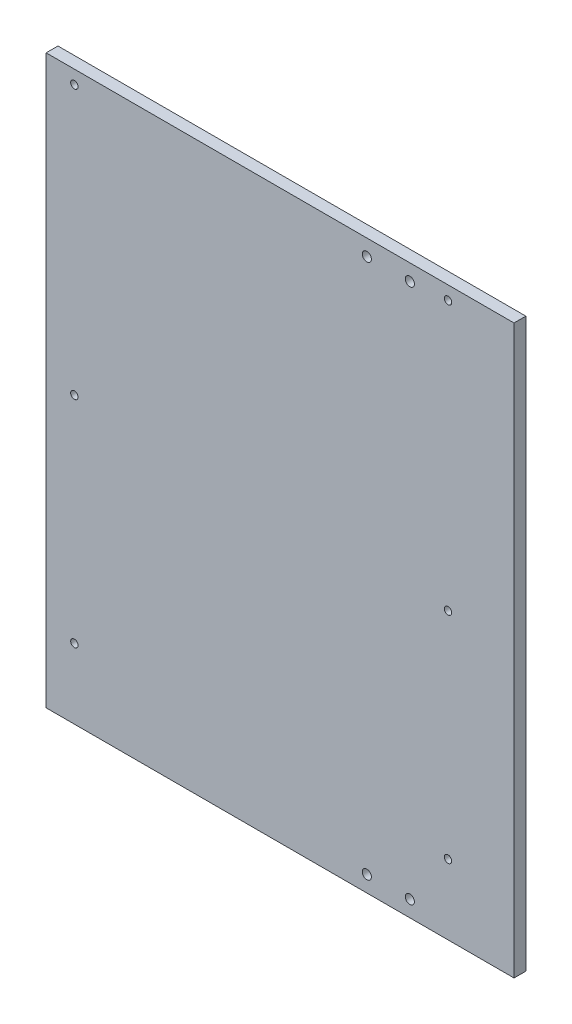
ISO-10303-21;
HEADER;
FILE_DESCRIPTION(('STEP AP214'),'2;1');
FILE_NAME('part.step','',(''),(''),'','','');
FILE_SCHEMA(('AUTOMOTIVE_DESIGN { 1 0 10303 214 1 1 1 1 }'));
ENDSEC;
DATA;
#1=APPLICATION_CONTEXT('core data for automotive mechanical design processes');
#2=APPLICATION_PROTOCOL_DEFINITION('international standard','automotive_design',2000,#1);
#3=PRODUCT_CONTEXT('',#1,'mechanical');
#4=PRODUCT('Part','Part','',(#3));
#5=PRODUCT_RELATED_PRODUCT_CATEGORY('part','',(#4));
#6=PRODUCT_DEFINITION_FORMATION('','',#4);
#7=PRODUCT_DEFINITION_CONTEXT('part definition',#1,'design');
#8=PRODUCT_DEFINITION('design','',#6,#7);
#9=PRODUCT_DEFINITION_SHAPE('','',#8);
#10=(LENGTH_UNIT() NAMED_UNIT(*) SI_UNIT(.MILLI.,.METRE.));
#11=(NAMED_UNIT(*) PLANE_ANGLE_UNIT() SI_UNIT($,.RADIAN.));
#12=(NAMED_UNIT(*) SI_UNIT($,.STERADIAN.) SOLID_ANGLE_UNIT());
#13=UNCERTAINTY_MEASURE_WITH_UNIT(LENGTH_MEASURE(1.E-05),#10,'distance_accuracy_value','');
#14=(GEOMETRIC_REPRESENTATION_CONTEXT(3) GLOBAL_UNCERTAINTY_ASSIGNED_CONTEXT((#13)) GLOBAL_UNIT_ASSIGNED_CONTEXT((#10,
#11,#12)) REPRESENTATION_CONTEXT('',''));
#15=CARTESIAN_POINT('',(0.,0.,0.));
#16=DIRECTION('',(0.,0.,1.));
#17=DIRECTION('',(1.,0.,0.));
#18=AXIS2_PLACEMENT_3D('',#15,#16,#17);
#19=CARTESIAN_POINT('',(44.7971998147837,-426.085183533713,4.4));
#20=DIRECTION('',(-1.,0.,0.));
#21=DIRECTION('',(0.,-1.,0.));
#22=AXIS2_PLACEMENT_3D('',#19,#20,#21);
#23=PLANE('',#22);
#24=DIRECTION('',(0.,1.,0.));
#25=VECTOR('',#24,1.);
#26=CARTESIAN_POINT('',(44.7971998147837,-426.085183533713,0.));
#27=LINE('',#26,#25);
#28=CARTESIAN_POINT('',(44.7971998147837,-426.085183533713,0.));
#29=VERTEX_POINT('',#28);
#30=CARTESIAN_POINT('',(44.7971998147837,-215.037785913899,0.));
#31=VERTEX_POINT('',#30);
#32=EDGE_CURVE('E97',#29,#31,#27,.T.);
#33=ORIENTED_EDGE('',*,*,#32,.T.);
#34=DIRECTION('',(0.,0.,-1.));
#35=VECTOR('',#34,1.);
#36=CARTESIAN_POINT('',(44.7971998147837,-215.037785913899,4.4));
#37=LINE('',#36,#35);
#38=CARTESIAN_POINT('',(44.7971998147837,-215.037785913899,4.4));
#39=VERTEX_POINT('',#38);
#40=EDGE_CURVE('E11',#39,#31,#37,.T.);
#41=ORIENTED_EDGE('',*,*,#40,.F.);
#42=DIRECTION('',(0.,1.,0.));
#43=VECTOR('',#42,1.);
#44=CARTESIAN_POINT('',(44.7971998147837,-426.085183533713,4.4));
#45=LINE('',#44,#43);
#46=CARTESIAN_POINT('',(44.7971998147837,-426.085183533713,4.4));
#47=VERTEX_POINT('',#46);
#48=EDGE_CURVE('E85',#47,#39,#45,.T.);
#49=ORIENTED_EDGE('',*,*,#48,.F.);
#50=DIRECTION('',(0.,0.,-1.));
#51=VECTOR('',#50,1.);
#52=CARTESIAN_POINT('',(44.7971998147837,-426.085183533713,4.4));
#53=LINE('',#52,#51);
#54=EDGE_CURVE('E93',#47,#29,#53,.T.);
#55=ORIENTED_EDGE('',*,*,#54,.T.);
#56=EDGE_LOOP('',(#33,#41,#49,#55));
#57=FACE_BOUND('',#56,.T.);
#58=ADVANCED_FACE('F34',(#57),#23,.F.);
#59=CARTESIAN_POINT('',(-129.266961018417,-215.037785913899,4.4));
#60=DIRECTION('',(0.,-1.,0.));
#61=DIRECTION('',(0.,0.,-1.));
#62=AXIS2_PLACEMENT_3D('',#59,#60,#61);
#63=PLANE('',#62);
#64=DIRECTION('',(-1.,0.,0.));
#65=VECTOR('',#64,1.);
#66=CARTESIAN_POINT('',(-129.266961018417,-215.037785913899,0.));
#67=LINE('',#66,#65);
#68=CARTESIAN_POINT('',(-129.266961018417,-215.037785913899,0.));
#69=VERTEX_POINT('',#68);
#70=EDGE_CURVE('E89',#31,#69,#67,.T.);
#71=ORIENTED_EDGE('',*,*,#70,.T.);
#72=DIRECTION('',(0.,0.,-1.));
#73=VECTOR('',#72,1.);
#74=CARTESIAN_POINT('',(-129.266961018417,-215.037785913899,4.4));
#75=LINE('',#74,#73);
#76=CARTESIAN_POINT('',(-129.266961018417,-215.037785913899,4.4));
#77=VERTEX_POINT('',#76);
#78=EDGE_CURVE('E42',#77,#69,#75,.T.);
#79=ORIENTED_EDGE('',*,*,#78,.F.);
#80=DIRECTION('',(-1.,0.,0.));
#81=VECTOR('',#80,1.);
#82=CARTESIAN_POINT('',(-129.266961018417,-215.037785913899,4.4));
#83=LINE('',#82,#81);
#84=EDGE_CURVE('E80',#39,#77,#83,.T.);
#85=ORIENTED_EDGE('',*,*,#84,.F.);
#86=ORIENTED_EDGE('',*,*,#40,.T.);
#87=EDGE_LOOP('',(#71,#79,#85,#86));
#88=FACE_BOUND('',#87,.T.);
#89=ADVANCED_FACE('F88',(#88),#63,.F.);
#90=CARTESIAN_POINT('',(-129.266961018417,-426.085183533713,4.4));
#91=DIRECTION('',(1.,0.,0.));
#92=DIRECTION('',(0.,0.,-1.));
#93=AXIS2_PLACEMENT_3D('',#90,#91,#92);
#94=PLANE('',#93);
#95=DIRECTION('',(0.,-1.,0.));
#96=VECTOR('',#95,1.);
#97=CARTESIAN_POINT('',(-129.266961018417,-426.085183533713,0.));
#98=LINE('',#97,#96);
#99=CARTESIAN_POINT('',(-129.266961018417,-426.085183533713,0.));
#100=VERTEX_POINT('',#99);
#101=EDGE_CURVE('E67',#69,#100,#98,.T.);
#102=ORIENTED_EDGE('',*,*,#101,.T.);
#103=DIRECTION('',(0.,0.,-1.));
#104=VECTOR('',#103,1.);
#105=CARTESIAN_POINT('',(-129.266961018417,-426.085183533713,4.4));
#106=LINE('',#105,#104);
#107=CARTESIAN_POINT('',(-129.266961018417,-426.085183533713,4.4));
#108=VERTEX_POINT('',#107);
#109=EDGE_CURVE('E90',#108,#100,#106,.T.);
#110=ORIENTED_EDGE('',*,*,#109,.F.);
#111=DIRECTION('',(0.,-1.,0.));
#112=VECTOR('',#111,1.);
#113=CARTESIAN_POINT('',(-129.266961018417,-426.085183533713,4.4));
#114=LINE('',#113,#112);
#115=EDGE_CURVE('E83',#77,#108,#114,.T.);
#116=ORIENTED_EDGE('',*,*,#115,.F.);
#117=ORIENTED_EDGE('',*,*,#78,.T.);
#118=EDGE_LOOP('',(#102,#110,#116,#117));
#119=FACE_BOUND('',#118,.T.);
#120=ADVANCED_FACE('F91',(#119),#94,.F.);
#121=CARTESIAN_POINT('',(-129.266961018417,-426.085183533713,4.4));
#122=DIRECTION('',(0.,1.,0.));
#123=DIRECTION('',(0.,0.,1.));
#124=AXIS2_PLACEMENT_3D('',#121,#122,#123);
#125=PLANE('',#124);
#126=DIRECTION('',(1.,0.,0.));
#127=VECTOR('',#126,1.);
#128=CARTESIAN_POINT('',(-129.266961018417,-426.085183533713,0.));
#129=LINE('',#128,#127);
#130=EDGE_CURVE('E73',#100,#29,#129,.T.);
#131=ORIENTED_EDGE('',*,*,#130,.T.);
#132=ORIENTED_EDGE('',*,*,#54,.F.);
#133=DIRECTION('',(1.,0.,0.));
#134=VECTOR('',#133,1.);
#135=CARTESIAN_POINT('',(-129.266961018417,-426.085183533713,4.4));
#136=LINE('',#135,#134);
#137=EDGE_CURVE('E50',#108,#47,#136,.T.);
#138=ORIENTED_EDGE('',*,*,#137,.F.);
#139=ORIENTED_EDGE('',*,*,#109,.T.);
#140=EDGE_LOOP('',(#131,#132,#138,#139));
#141=FACE_BOUND('',#140,.T.);
#142=ADVANCED_FACE('F105',(#141),#125,.F.);
#143=CARTESIAN_POINT('',(0.,0.,4.4));
#144=DIRECTION('',(0.,0.,-1.));
#145=DIRECTION('',(-1.,0.,0.));
#146=AXIS2_PLACEMENT_3D('',#143,#144,#145);
#147=PLANE('',#146);
#148=CARTESIAN_POINT('',(-9.96740718036357,-420.085183533739,4.4));
#149=DIRECTION('',(0.,0.,1.));
#150=DIRECTION('',(1.,0.,0.));
#151=AXIS2_PLACEMENT_3D('',#148,#149,#150);
#152=CIRCLE('',#151,1.7);
#153=CARTESIAN_POINT('',(-8.26740718036356,-420.085183533739,4.4));
#154=VERTEX_POINT('',#153);
#155=EDGE_CURVE('E167',#154,#154,#152,.T.);
#156=ORIENTED_EDGE('',*,*,#155,.F.);
#157=EDGE_LOOP('',(#156));
#158=FACE_BOUND('',#157,.T.);
#159=CARTESIAN_POINT('',(6.0401928196301,-420.085183533725,4.4));
#160=DIRECTION('',(0.,0.,1.));
#161=DIRECTION('',(1.,0.,0.));
#162=AXIS2_PLACEMENT_3D('',#159,#160,#161);
#163=CIRCLE('',#162,1.7);
#164=CARTESIAN_POINT('',(7.74019281963009,-420.085183533725,4.4));
#165=VERTEX_POINT('',#164);
#166=EDGE_CURVE('E161',#165,#165,#163,.T.);
#167=ORIENTED_EDGE('',*,*,#166,.F.);
#168=EDGE_LOOP('',(#167));
#169=FACE_BOUND('',#168,.T.);
#170=CARTESIAN_POINT('',(-9.96740718036021,-221.037785913899,4.4));
#171=DIRECTION('',(0.,0.,1.));
#172=DIRECTION('',(1.,0.,0.));
#173=AXIS2_PLACEMENT_3D('',#170,#171,#172);
#174=CIRCLE('',#173,1.7);
#175=CARTESIAN_POINT('',(-8.26740718036021,-221.037785913899,4.4));
#176=VERTEX_POINT('',#175);
#177=EDGE_CURVE('E155',#176,#176,#174,.T.);
#178=ORIENTED_EDGE('',*,*,#177,.F.);
#179=EDGE_LOOP('',(#178));
#180=FACE_BOUND('',#179,.T.);
#181=CARTESIAN_POINT('',(6.0401928196398,-221.037785913899,4.4));
#182=DIRECTION('',(0.,0.,1.));
#183=DIRECTION('',(1.,0.,0.));
#184=AXIS2_PLACEMENT_3D('',#181,#182,#183);
#185=CIRCLE('',#184,1.7);
#186=CARTESIAN_POINT('',(7.7401928196398,-221.037785913899,4.4));
#187=VERTEX_POINT('',#186);
#188=EDGE_CURVE('E149',#187,#187,#185,.T.);
#189=ORIENTED_EDGE('',*,*,#188,.F.);
#190=EDGE_LOOP('',(#189));
#191=FACE_BOUND('',#190,.T.);
#192=CARTESIAN_POINT('',(-118.766961018415,-220.037785913897,4.4));
#193=DIRECTION('',(0.,0.,1.));
#194=DIRECTION('',(1.,0.,0.));
#195=AXIS2_PLACEMENT_3D('',#192,#193,#194);
#196=CIRCLE('',#195,1.375);
#197=CARTESIAN_POINT('',(-117.391961018415,-220.037785913897,4.4));
#198=VERTEX_POINT('',#197);
#199=EDGE_CURVE('E143',#198,#198,#196,.T.);
#200=ORIENTED_EDGE('',*,*,#199,.F.);
#201=EDGE_LOOP('',(#200));
#202=FACE_BOUND('',#201,.T.);
#203=CARTESIAN_POINT('',(20.2330389815884,-220.0377859139,4.4));
#204=DIRECTION('',(0.,0.,1.));
#205=DIRECTION('',(1.,0.,0.));
#206=AXIS2_PLACEMENT_3D('',#203,#204,#205);
#207=CIRCLE('',#206,1.375);
#208=CARTESIAN_POINT('',(21.6080389815884,-220.0377859139,4.4));
#209=VERTEX_POINT('',#208);
#210=EDGE_CURVE('E137',#209,#209,#207,.T.);
#211=ORIENTED_EDGE('',*,*,#210,.F.);
#212=EDGE_LOOP('',(#211));
#213=FACE_BOUND('',#212,.T.);
#214=CARTESIAN_POINT('',(-118.766961018416,-320.037785913897,4.4));
#215=DIRECTION('',(0.,0.,1.));
#216=DIRECTION('',(1.,0.,0.));
#217=AXIS2_PLACEMENT_3D('',#214,#215,#216);
#218=CIRCLE('',#217,1.375);
#219=CARTESIAN_POINT('',(-117.391961018416,-320.037785913897,4.4));
#220=VERTEX_POINT('',#219);
#221=EDGE_CURVE('E131',#220,#220,#218,.T.);
#222=ORIENTED_EDGE('',*,*,#221,.F.);
#223=EDGE_LOOP('',(#222));
#224=FACE_BOUND('',#223,.T.);
#225=CARTESIAN_POINT('',(20.2330389815871,-320.0377859139,4.4));
#226=DIRECTION('',(0.,0.,1.));
#227=DIRECTION('',(1.,0.,0.));
#228=AXIS2_PLACEMENT_3D('',#225,#226,#227);
#229=CIRCLE('',#228,1.375);
#230=CARTESIAN_POINT('',(21.6080389815871,-320.0377859139,4.4));
#231=VERTEX_POINT('',#230);
#232=EDGE_CURVE('E125',#231,#231,#229,.T.);
#233=ORIENTED_EDGE('',*,*,#232,.F.);
#234=EDGE_LOOP('',(#233));
#235=FACE_BOUND('',#234,.T.);
#236=CARTESIAN_POINT('',(20.2330389815861,-400.0377859139,4.4));
#237=DIRECTION('',(0.,0.,1.));
#238=DIRECTION('',(1.,0.,0.));
#239=AXIS2_PLACEMENT_3D('',#236,#237,#238);
#240=CIRCLE('',#239,1.375);
#241=CARTESIAN_POINT('',(21.6080389815861,-400.0377859139,4.4));
#242=VERTEX_POINT('',#241);
#243=EDGE_CURVE('E119',#242,#242,#240,.T.);
#244=ORIENTED_EDGE('',*,*,#243,.F.);
#245=EDGE_LOOP('',(#244));
#246=FACE_BOUND('',#245,.T.);
#247=CARTESIAN_POINT('',(-118.766961018417,-400.037785913897,4.4));
#248=DIRECTION('',(0.,0.,1.));
#249=DIRECTION('',(1.,0.,0.));
#250=AXIS2_PLACEMENT_3D('',#247,#248,#249);
#251=CIRCLE('',#250,1.375);
#252=CARTESIAN_POINT('',(-117.391961018417,-400.037785913897,4.4));
#253=VERTEX_POINT('',#252);
#254=EDGE_CURVE('E113',#253,#253,#251,.T.);
#255=ORIENTED_EDGE('',*,*,#254,.F.);
#256=EDGE_LOOP('',(#255));
#257=FACE_BOUND('',#256,.T.);
#258=ORIENTED_EDGE('',*,*,#48,.T.);
#259=ORIENTED_EDGE('',*,*,#84,.T.);
#260=ORIENTED_EDGE('',*,*,#115,.T.);
#261=ORIENTED_EDGE('',*,*,#137,.T.);
#262=EDGE_LOOP('',(#258,#259,#260,#261));
#263=FACE_BOUND('',#262,.T.);
#264=ADVANCED_FACE('F81',(#158,#169,#180,#191,#202,#213,#224,#235,#246,#257,#263),#147,.F.);
#265=CARTESIAN_POINT('',(0.,0.,0.));
#266=DIRECTION('',(0.,0.,-1.));
#267=DIRECTION('',(-1.,0.,0.));
#268=AXIS2_PLACEMENT_3D('',#265,#266,#267);
#269=PLANE('',#268);
#270=CARTESIAN_POINT('',(-9.96740718036357,-420.085183533739,0.));
#271=DIRECTION('',(0.,0.,1.));
#272=DIRECTION('',(1.,0.,0.));
#273=AXIS2_PLACEMENT_3D('',#270,#271,#272);
#274=CIRCLE('',#273,1.7);
#275=CARTESIAN_POINT('',(-8.26740718036357,-420.085183533739,0.));
#276=VERTEX_POINT('',#275);
#277=EDGE_CURVE('E164',#276,#276,#274,.T.);
#278=ORIENTED_EDGE('',*,*,#277,.T.);
#279=EDGE_LOOP('',(#278));
#280=FACE_BOUND('',#279,.T.);
#281=CARTESIAN_POINT('',(6.0401928196301,-420.085183533725,0.));
#282=DIRECTION('',(0.,0.,1.));
#283=DIRECTION('',(1.,0.,0.));
#284=AXIS2_PLACEMENT_3D('',#281,#282,#283);
#285=CIRCLE('',#284,1.7);
#286=CARTESIAN_POINT('',(7.74019281963009,-420.085183533725,0.));
#287=VERTEX_POINT('',#286);
#288=EDGE_CURVE('E158',#287,#287,#285,.T.);
#289=ORIENTED_EDGE('',*,*,#288,.T.);
#290=EDGE_LOOP('',(#289));
#291=FACE_BOUND('',#290,.T.);
#292=CARTESIAN_POINT('',(-9.96740718036021,-221.037785913899,0.));
#293=DIRECTION('',(0.,0.,1.));
#294=DIRECTION('',(1.,0.,0.));
#295=AXIS2_PLACEMENT_3D('',#292,#293,#294);
#296=CIRCLE('',#295,1.7);
#297=CARTESIAN_POINT('',(-8.26740718036021,-221.037785913899,0.));
#298=VERTEX_POINT('',#297);
#299=EDGE_CURVE('E152',#298,#298,#296,.T.);
#300=ORIENTED_EDGE('',*,*,#299,.T.);
#301=EDGE_LOOP('',(#300));
#302=FACE_BOUND('',#301,.T.);
#303=CARTESIAN_POINT('',(6.0401928196398,-221.037785913899,0.));
#304=DIRECTION('',(0.,0.,1.));
#305=DIRECTION('',(1.,0.,0.));
#306=AXIS2_PLACEMENT_3D('',#303,#304,#305);
#307=CIRCLE('',#306,1.7);
#308=CARTESIAN_POINT('',(7.7401928196398,-221.037785913899,0.));
#309=VERTEX_POINT('',#308);
#310=EDGE_CURVE('E146',#309,#309,#307,.T.);
#311=ORIENTED_EDGE('',*,*,#310,.T.);
#312=EDGE_LOOP('',(#311));
#313=FACE_BOUND('',#312,.T.);
#314=CARTESIAN_POINT('',(-118.766961018415,-220.037785913897,0.));
#315=DIRECTION('',(0.,0.,1.));
#316=DIRECTION('',(1.,0.,0.));
#317=AXIS2_PLACEMENT_3D('',#314,#315,#316);
#318=CIRCLE('',#317,1.375);
#319=CARTESIAN_POINT('',(-117.391961018415,-220.037785913897,0.));
#320=VERTEX_POINT('',#319);
#321=EDGE_CURVE('E140',#320,#320,#318,.T.);
#322=ORIENTED_EDGE('',*,*,#321,.T.);
#323=EDGE_LOOP('',(#322));
#324=FACE_BOUND('',#323,.T.);
#325=CARTESIAN_POINT('',(20.2330389815884,-220.0377859139,0.));
#326=DIRECTION('',(0.,0.,1.));
#327=DIRECTION('',(1.,0.,0.));
#328=AXIS2_PLACEMENT_3D('',#325,#326,#327);
#329=CIRCLE('',#328,1.375);
#330=CARTESIAN_POINT('',(21.6080389815884,-220.0377859139,0.));
#331=VERTEX_POINT('',#330);
#332=EDGE_CURVE('E134',#331,#331,#329,.T.);
#333=ORIENTED_EDGE('',*,*,#332,.T.);
#334=EDGE_LOOP('',(#333));
#335=FACE_BOUND('',#334,.T.);
#336=CARTESIAN_POINT('',(-118.766961018416,-320.037785913897,0.));
#337=DIRECTION('',(0.,0.,1.));
#338=DIRECTION('',(1.,0.,0.));
#339=AXIS2_PLACEMENT_3D('',#336,#337,#338);
#340=CIRCLE('',#339,1.375);
#341=CARTESIAN_POINT('',(-117.391961018416,-320.037785913897,0.));
#342=VERTEX_POINT('',#341);
#343=EDGE_CURVE('E128',#342,#342,#340,.T.);
#344=ORIENTED_EDGE('',*,*,#343,.T.);
#345=EDGE_LOOP('',(#344));
#346=FACE_BOUND('',#345,.T.);
#347=CARTESIAN_POINT('',(20.2330389815871,-320.0377859139,0.));
#348=DIRECTION('',(0.,0.,1.));
#349=DIRECTION('',(1.,0.,0.));
#350=AXIS2_PLACEMENT_3D('',#347,#348,#349);
#351=CIRCLE('',#350,1.375);
#352=CARTESIAN_POINT('',(21.6080389815871,-320.0377859139,0.));
#353=VERTEX_POINT('',#352);
#354=EDGE_CURVE('E122',#353,#353,#351,.T.);
#355=ORIENTED_EDGE('',*,*,#354,.T.);
#356=EDGE_LOOP('',(#355));
#357=FACE_BOUND('',#356,.T.);
#358=CARTESIAN_POINT('',(20.2330389815861,-400.0377859139,0.));
#359=DIRECTION('',(0.,0.,1.));
#360=DIRECTION('',(1.,0.,0.));
#361=AXIS2_PLACEMENT_3D('',#358,#359,#360);
#362=CIRCLE('',#361,1.375);
#363=CARTESIAN_POINT('',(21.6080389815861,-400.0377859139,0.));
#364=VERTEX_POINT('',#363);
#365=EDGE_CURVE('E116',#364,#364,#362,.T.);
#366=ORIENTED_EDGE('',*,*,#365,.T.);
#367=EDGE_LOOP('',(#366));
#368=FACE_BOUND('',#367,.T.);
#369=CARTESIAN_POINT('',(-118.766961018417,-400.037785913897,0.));
#370=DIRECTION('',(0.,0.,1.));
#371=DIRECTION('',(1.,0.,0.));
#372=AXIS2_PLACEMENT_3D('',#369,#370,#371);
#373=CIRCLE('',#372,1.375);
#374=CARTESIAN_POINT('',(-117.391961018417,-400.037785913897,0.));
#375=VERTEX_POINT('',#374);
#376=EDGE_CURVE('E100',#375,#375,#373,.T.);
#377=ORIENTED_EDGE('',*,*,#376,.T.);
#378=EDGE_LOOP('',(#377));
#379=FACE_BOUND('',#378,.T.);
#380=ORIENTED_EDGE('',*,*,#32,.F.);
#381=ORIENTED_EDGE('',*,*,#130,.F.);
#382=ORIENTED_EDGE('',*,*,#101,.F.);
#383=ORIENTED_EDGE('',*,*,#70,.F.);
#384=EDGE_LOOP('',(#380,#381,#382,#383));
#385=FACE_BOUND('',#384,.T.);
#386=ADVANCED_FACE('F108',(#280,#291,#302,#313,#324,#335,#346,#357,#368,#379,#385),#269,.T.);
#387=CARTESIAN_POINT('',(-118.766961018417,-400.037785913897,4.4));
#388=DIRECTION('',(0.,0.,1.));
#389=DIRECTION('',(1.,0.,0.));
#390=AXIS2_PLACEMENT_3D('',#387,#388,#389);
#391=CYLINDRICAL_SURFACE('',#390,1.375);
#392=ORIENTED_EDGE('',*,*,#376,.F.);
#393=EDGE_LOOP('',(#392));
#394=FACE_BOUND('',#393,.T.);
#395=ORIENTED_EDGE('',*,*,#254,.T.);
#396=EDGE_LOOP('',(#395));
#397=FACE_BOUND('',#396,.T.);
#398=ADVANCED_FACE('F194',(#394,#397),#391,.F.);
#399=CARTESIAN_POINT('',(20.2330389815861,-400.0377859139,4.4));
#400=DIRECTION('',(0.,0.,1.));
#401=DIRECTION('',(1.,0.,0.));
#402=AXIS2_PLACEMENT_3D('',#399,#400,#401);
#403=CYLINDRICAL_SURFACE('',#402,1.375);
#404=ORIENTED_EDGE('',*,*,#365,.F.);
#405=EDGE_LOOP('',(#404));
#406=FACE_BOUND('',#405,.T.);
#407=ORIENTED_EDGE('',*,*,#243,.T.);
#408=EDGE_LOOP('',(#407));
#409=FACE_BOUND('',#408,.T.);
#410=ADVANCED_FACE('F196',(#406,#409),#403,.F.);
#411=CARTESIAN_POINT('',(20.2330389815871,-320.0377859139,4.4));
#412=DIRECTION('',(0.,0.,1.));
#413=DIRECTION('',(1.,0.,0.));
#414=AXIS2_PLACEMENT_3D('',#411,#412,#413);
#415=CYLINDRICAL_SURFACE('',#414,1.375);
#416=ORIENTED_EDGE('',*,*,#354,.F.);
#417=EDGE_LOOP('',(#416));
#418=FACE_BOUND('',#417,.T.);
#419=ORIENTED_EDGE('',*,*,#232,.T.);
#420=EDGE_LOOP('',(#419));
#421=FACE_BOUND('',#420,.T.);
#422=ADVANCED_FACE('F203',(#418,#421),#415,.F.);
#423=CARTESIAN_POINT('',(-118.766961018416,-320.037785913897,4.4));
#424=DIRECTION('',(0.,0.,1.));
#425=DIRECTION('',(1.,0.,0.));
#426=AXIS2_PLACEMENT_3D('',#423,#424,#425);
#427=CYLINDRICAL_SURFACE('',#426,1.375);
#428=ORIENTED_EDGE('',*,*,#343,.F.);
#429=EDGE_LOOP('',(#428));
#430=FACE_BOUND('',#429,.T.);
#431=ORIENTED_EDGE('',*,*,#221,.T.);
#432=EDGE_LOOP('',(#431));
#433=FACE_BOUND('',#432,.T.);
#434=ADVANCED_FACE('F286',(#430,#433),#427,.F.);
#435=CARTESIAN_POINT('',(20.2330389815884,-220.0377859139,4.4));
#436=DIRECTION('',(0.,0.,1.));
#437=DIRECTION('',(1.,0.,0.));
#438=AXIS2_PLACEMENT_3D('',#435,#436,#437);
#439=CYLINDRICAL_SURFACE('',#438,1.375);
#440=ORIENTED_EDGE('',*,*,#332,.F.);
#441=EDGE_LOOP('',(#440));
#442=FACE_BOUND('',#441,.T.);
#443=ORIENTED_EDGE('',*,*,#210,.T.);
#444=EDGE_LOOP('',(#443));
#445=FACE_BOUND('',#444,.T.);
#446=ADVANCED_FACE('F282',(#442,#445),#439,.F.);
#447=CARTESIAN_POINT('',(-118.766961018415,-220.037785913897,4.4));
#448=DIRECTION('',(0.,0.,1.));
#449=DIRECTION('',(1.,0.,0.));
#450=AXIS2_PLACEMENT_3D('',#447,#448,#449);
#451=CYLINDRICAL_SURFACE('',#450,1.375);
#452=ORIENTED_EDGE('',*,*,#321,.F.);
#453=EDGE_LOOP('',(#452));
#454=FACE_BOUND('',#453,.T.);
#455=ORIENTED_EDGE('',*,*,#199,.T.);
#456=EDGE_LOOP('',(#455));
#457=FACE_BOUND('',#456,.T.);
#458=ADVANCED_FACE('F244',(#454,#457),#451,.F.);
#459=CARTESIAN_POINT('',(6.0401928196398,-221.037785913899,4.4));
#460=DIRECTION('',(0.,0.,1.));
#461=DIRECTION('',(1.,0.,0.));
#462=AXIS2_PLACEMENT_3D('',#459,#460,#461);
#463=CYLINDRICAL_SURFACE('',#462,1.7);
#464=ORIENTED_EDGE('',*,*,#310,.F.);
#465=EDGE_LOOP('',(#464));
#466=FACE_BOUND('',#465,.T.);
#467=ORIENTED_EDGE('',*,*,#188,.T.);
#468=EDGE_LOOP('',(#467));
#469=FACE_BOUND('',#468,.T.);
#470=ADVANCED_FACE('F238',(#466,#469),#463,.F.);
#471=CARTESIAN_POINT('',(-9.96740718036021,-221.037785913899,4.4));
#472=DIRECTION('',(0.,0.,1.));
#473=DIRECTION('',(1.,0.,0.));
#474=AXIS2_PLACEMENT_3D('',#471,#472,#473);
#475=CYLINDRICAL_SURFACE('',#474,1.7);
#476=ORIENTED_EDGE('',*,*,#299,.F.);
#477=EDGE_LOOP('',(#476));
#478=FACE_BOUND('',#477,.T.);
#479=ORIENTED_EDGE('',*,*,#177,.T.);
#480=EDGE_LOOP('',(#479));
#481=FACE_BOUND('',#480,.T.);
#482=ADVANCED_FACE('F243',(#478,#481),#475,.F.);
#483=CARTESIAN_POINT('',(6.0401928196301,-420.085183533725,4.4));
#484=DIRECTION('',(0.,0.,1.));
#485=DIRECTION('',(1.,0.,0.));
#486=AXIS2_PLACEMENT_3D('',#483,#484,#485);
#487=CYLINDRICAL_SURFACE('',#486,1.7);
#488=ORIENTED_EDGE('',*,*,#288,.F.);
#489=EDGE_LOOP('',(#488));
#490=FACE_BOUND('',#489,.T.);
#491=ORIENTED_EDGE('',*,*,#166,.T.);
#492=EDGE_LOOP('',(#491));
#493=FACE_BOUND('',#492,.T.);
#494=ADVANCED_FACE('F256',(#490,#493),#487,.F.);
#495=CARTESIAN_POINT('',(-9.96740718036357,-420.085183533739,4.4));
#496=DIRECTION('',(0.,0.,1.));
#497=DIRECTION('',(1.,0.,0.));
#498=AXIS2_PLACEMENT_3D('',#495,#496,#497);
#499=CYLINDRICAL_SURFACE('',#498,1.7);
#500=ORIENTED_EDGE('',*,*,#277,.F.);
#501=EDGE_LOOP('',(#500));
#502=FACE_BOUND('',#501,.T.);
#503=ORIENTED_EDGE('',*,*,#155,.T.);
#504=EDGE_LOOP('',(#503));
#505=FACE_BOUND('',#504,.T.);
#506=ADVANCED_FACE('F171',(#502,#505),#499,.F.);
#507=CLOSED_SHELL('',(#58,#89,#120,#142,#264,#386,#398,#410,#422,#434,#446,#458,#470,#482,#494,#506));
#508=MANIFOLD_SOLID_BREP('B2',#507);
#509=ADVANCED_BREP_SHAPE_REPRESENTATION('',(#18,#508),#14);
#510=SHAPE_DEFINITION_REPRESENTATION(#9,#509);
ENDSEC;
END-ISO-10303-21;
